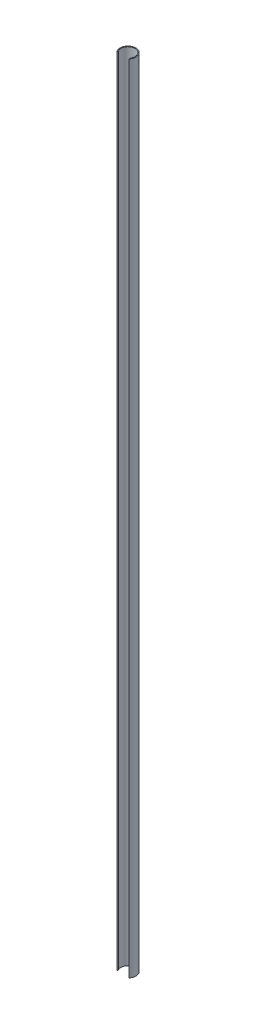
ISO-10303-21;
HEADER;
FILE_DESCRIPTION(('STEP AP214'),'2;1');
FILE_NAME('part.step','',(''),(''),'','','');
FILE_SCHEMA(('AUTOMOTIVE_DESIGN { 1 0 10303 214 1 1 1 1 }'));
ENDSEC;
DATA;
#1=APPLICATION_CONTEXT('core data for automotive mechanical design processes');
#2=APPLICATION_PROTOCOL_DEFINITION('international standard','automotive_design',2000,#1);
#3=PRODUCT_CONTEXT('',#1,'mechanical');
#4=PRODUCT('Part','Part','',(#3));
#5=PRODUCT_RELATED_PRODUCT_CATEGORY('part','',(#4));
#6=PRODUCT_DEFINITION_FORMATION('','',#4);
#7=PRODUCT_DEFINITION_CONTEXT('part definition',#1,'design');
#8=PRODUCT_DEFINITION('design','',#6,#7);
#9=PRODUCT_DEFINITION_SHAPE('','',#8);
#10=(LENGTH_UNIT() NAMED_UNIT(*) SI_UNIT(.MILLI.,.METRE.));
#11=(NAMED_UNIT(*) PLANE_ANGLE_UNIT() SI_UNIT($,.RADIAN.));
#12=(NAMED_UNIT(*) SI_UNIT($,.STERADIAN.) SOLID_ANGLE_UNIT());
#13=UNCERTAINTY_MEASURE_WITH_UNIT(LENGTH_MEASURE(1.E-05),#10,'distance_accuracy_value','');
#14=(GEOMETRIC_REPRESENTATION_CONTEXT(3) GLOBAL_UNCERTAINTY_ASSIGNED_CONTEXT((#13)) GLOBAL_UNIT_ASSIGNED_CONTEXT((#10,
#11,#12)) REPRESENTATION_CONTEXT('',''));
#15=CARTESIAN_POINT('',(0.,0.,0.));
#16=DIRECTION('',(0.,0.,1.));
#17=DIRECTION('',(1.,0.,0.));
#18=AXIS2_PLACEMENT_3D('',#15,#16,#17);
#19=CARTESIAN_POINT('',(0.,90.,0.));
#20=DIRECTION('',(0.,1.,0.));
#21=DIRECTION('',(0.,0.,1.));
#22=AXIS2_PLACEMENT_3D('',#19,#20,#21);
#23=PLANE('',#22);
#24=DIRECTION('',(0.,0.,-1.));
#25=VECTOR('',#24,1.);
#26=CARTESIAN_POINT('',(0.7,90.,0.9017));
#27=LINE('',#26,#25);
#28=CARTESIAN_POINT('',(0.7,90.,0.568386215526027));
#29=VERTEX_POINT('',#28);
#30=CARTESIAN_POINT('',(0.7,90.,0.387504851582532));
#31=VERTEX_POINT('',#30);
#32=EDGE_CURVE('E54',#29,#31,#27,.T.);
#33=ORIENTED_EDGE('',*,*,#32,.F.);
#34=CARTESIAN_POINT('',(0.,90.,0.));
#35=DIRECTION('',(0.,1.,0.));
#36=DIRECTION('',(0.,0.,1.));
#37=AXIS2_PLACEMENT_3D('',#34,#35,#36);
#38=CIRCLE('',#37,0.9017);
#39=CARTESIAN_POINT('',(-0.7,90.,0.568386215526027));
#40=VERTEX_POINT('',#39);
#41=EDGE_CURVE('E85',#29,#40,#38,.T.);
#42=ORIENTED_EDGE('',*,*,#41,.T.);
#43=DIRECTION('',(0.,0.,1.));
#44=VECTOR('',#43,1.);
#45=CARTESIAN_POINT('',(-0.7,90.,0.9017));
#46=LINE('',#45,#44);
#47=CARTESIAN_POINT('',(-0.7,90.,0.387504851582532));
#48=VERTEX_POINT('',#47);
#49=EDGE_CURVE('E88',#48,#40,#46,.T.);
#50=ORIENTED_EDGE('',*,*,#49,.F.);
#51=CARTESIAN_POINT('',(0.,90.,0.));
#52=DIRECTION('',(0.,1.,0.));
#53=DIRECTION('',(0.,0.,1.));
#54=AXIS2_PLACEMENT_3D('',#51,#52,#53);
#55=CIRCLE('',#54,0.8001);
#56=EDGE_CURVE('E87',#31,#48,#55,.T.);
#57=ORIENTED_EDGE('',*,*,#56,.F.);
#58=EDGE_LOOP('',(#33,#42,#50,#57));
#59=FACE_BOUND('',#58,.T.);
#60=ADVANCED_FACE('F32',(#59),#23,.T.);
#61=CARTESIAN_POINT('',(0.,0.,0.));
#62=DIRECTION('',(0.,1.,0.));
#63=DIRECTION('',(0.,0.,1.));
#64=AXIS2_PLACEMENT_3D('',#61,#62,#63);
#65=PLANE('',#64);
#66=CARTESIAN_POINT('',(0.,0.,0.));
#67=DIRECTION('',(0.,1.,0.));
#68=DIRECTION('',(0.,0.,1.));
#69=AXIS2_PLACEMENT_3D('',#66,#67,#68);
#70=CIRCLE('',#69,0.9017);
#71=CARTESIAN_POINT('',(0.7,0.,0.568386215526027));
#72=VERTEX_POINT('',#71);
#73=CARTESIAN_POINT('',(-0.7,0.,0.568386215526027));
#74=VERTEX_POINT('',#73);
#75=EDGE_CURVE('E91',#72,#74,#70,.T.);
#76=ORIENTED_EDGE('',*,*,#75,.F.);
#77=DIRECTION('',(0.,0.,-1.));
#78=VECTOR('',#77,1.);
#79=CARTESIAN_POINT('',(0.7,0.,0.9017));
#80=LINE('',#79,#78);
#81=CARTESIAN_POINT('',(0.7,0.,0.387504851582532));
#82=VERTEX_POINT('',#81);
#83=EDGE_CURVE('E73',#72,#82,#80,.T.);
#84=ORIENTED_EDGE('',*,*,#83,.T.);
#85=CARTESIAN_POINT('',(0.,0.,0.));
#86=DIRECTION('',(0.,1.,0.));
#87=DIRECTION('',(0.,0.,1.));
#88=AXIS2_PLACEMENT_3D('',#85,#86,#87);
#89=CIRCLE('',#88,0.8001);
#90=CARTESIAN_POINT('',(-0.7,0.,0.387504851582532));
#91=VERTEX_POINT('',#90);
#92=EDGE_CURVE('E78',#82,#91,#89,.T.);
#93=ORIENTED_EDGE('',*,*,#92,.T.);
#94=DIRECTION('',(0.,0.,1.));
#95=VECTOR('',#94,1.);
#96=CARTESIAN_POINT('',(-0.7,0.,0.9017));
#97=LINE('',#96,#95);
#98=EDGE_CURVE('E47',#91,#74,#97,.T.);
#99=ORIENTED_EDGE('',*,*,#98,.T.);
#100=EDGE_LOOP('',(#76,#84,#93,#99));
#101=FACE_BOUND('',#100,.T.);
#102=ADVANCED_FACE('F103',(#101),#65,.F.);
#103=CARTESIAN_POINT('',(0.,90.,0.));
#104=DIRECTION('',(0.,-1.,0.));
#105=DIRECTION('',(0.,0.,-1.));
#106=AXIS2_PLACEMENT_3D('',#103,#104,#105);
#107=CYLINDRICAL_SURFACE('',#106,0.9017);
#108=ORIENTED_EDGE('',*,*,#41,.F.);
#109=DIRECTION('',(0.,-1.,0.));
#110=VECTOR('',#109,1.);
#111=CARTESIAN_POINT('',(0.7,90.,0.568386215526028));
#112=LINE('',#111,#110);
#113=EDGE_CURVE('E70',#29,#72,#112,.T.);
#114=ORIENTED_EDGE('',*,*,#113,.T.);
#115=ORIENTED_EDGE('',*,*,#75,.T.);
#116=DIRECTION('',(0.,-1.,0.));
#117=VECTOR('',#116,1.);
#118=CARTESIAN_POINT('',(-0.7,90.,0.568386215526028));
#119=LINE('',#118,#117);
#120=EDGE_CURVE('E79',#74,#40,#119,.F.);
#121=ORIENTED_EDGE('',*,*,#120,.T.);
#122=EDGE_LOOP('',(#108,#114,#115,#121));
#123=FACE_BOUND('',#122,.T.);
#124=ADVANCED_FACE('F34',(#123),#107,.T.);
#125=CARTESIAN_POINT('',(0.,90.,0.));
#126=DIRECTION('',(0.,-1.,0.));
#127=DIRECTION('',(0.,0.,-1.));
#128=AXIS2_PLACEMENT_3D('',#125,#126,#127);
#129=CYLINDRICAL_SURFACE('',#128,0.8001);
#130=DIRECTION('',(0.,-1.,0.));
#131=VECTOR('',#130,1.);
#132=CARTESIAN_POINT('',(0.7,90.,0.387504851582532));
#133=LINE('',#132,#131);
#134=EDGE_CURVE('E11',#31,#82,#133,.T.);
#135=ORIENTED_EDGE('',*,*,#134,.F.);
#136=ORIENTED_EDGE('',*,*,#56,.T.);
#137=DIRECTION('',(0.,-1.,0.));
#138=VECTOR('',#137,1.);
#139=CARTESIAN_POINT('',(-0.7,90.,0.387504851582532));
#140=LINE('',#139,#138);
#141=EDGE_CURVE('E40',#91,#48,#140,.F.);
#142=ORIENTED_EDGE('',*,*,#141,.F.);
#143=ORIENTED_EDGE('',*,*,#92,.F.);
#144=EDGE_LOOP('',(#135,#136,#142,#143));
#145=FACE_BOUND('',#144,.T.);
#146=ADVANCED_FACE('F105',(#145),#129,.F.);
#147=CARTESIAN_POINT('',(-0.7,0.,0.9017));
#148=DIRECTION('',(-1.,0.,0.));
#149=DIRECTION('',(0.,0.,1.));
#150=AXIS2_PLACEMENT_3D('',#147,#148,#149);
#151=PLANE('',#150);
#152=ORIENTED_EDGE('',*,*,#98,.F.);
#153=ORIENTED_EDGE('',*,*,#141,.T.);
#154=ORIENTED_EDGE('',*,*,#49,.T.);
#155=ORIENTED_EDGE('',*,*,#120,.F.);
#156=EDGE_LOOP('',(#152,#153,#154,#155));
#157=FACE_BOUND('',#156,.T.);
#158=ADVANCED_FACE('F106',(#157),#151,.F.);
#159=CARTESIAN_POINT('',(0.7,0.,0.9017));
#160=DIRECTION('',(1.,0.,0.));
#161=DIRECTION('',(0.,0.,-1.));
#162=AXIS2_PLACEMENT_3D('',#159,#160,#161);
#163=PLANE('',#162);
#164=ORIENTED_EDGE('',*,*,#32,.T.);
#165=ORIENTED_EDGE('',*,*,#134,.T.);
#166=ORIENTED_EDGE('',*,*,#83,.F.);
#167=ORIENTED_EDGE('',*,*,#113,.F.);
#168=EDGE_LOOP('',(#164,#165,#166,#167));
#169=FACE_BOUND('',#168,.T.);
#170=ADVANCED_FACE('F71',(#169),#163,.F.);
#171=CLOSED_SHELL('',(#60,#102,#124,#146,#158,#170));
#172=MANIFOLD_SOLID_BREP('B2',#171);
#173=ADVANCED_BREP_SHAPE_REPRESENTATION('',(#18,#172),#14);
#174=SHAPE_DEFINITION_REPRESENTATION(#9,#173);
ENDSEC;
END-ISO-10303-21;
